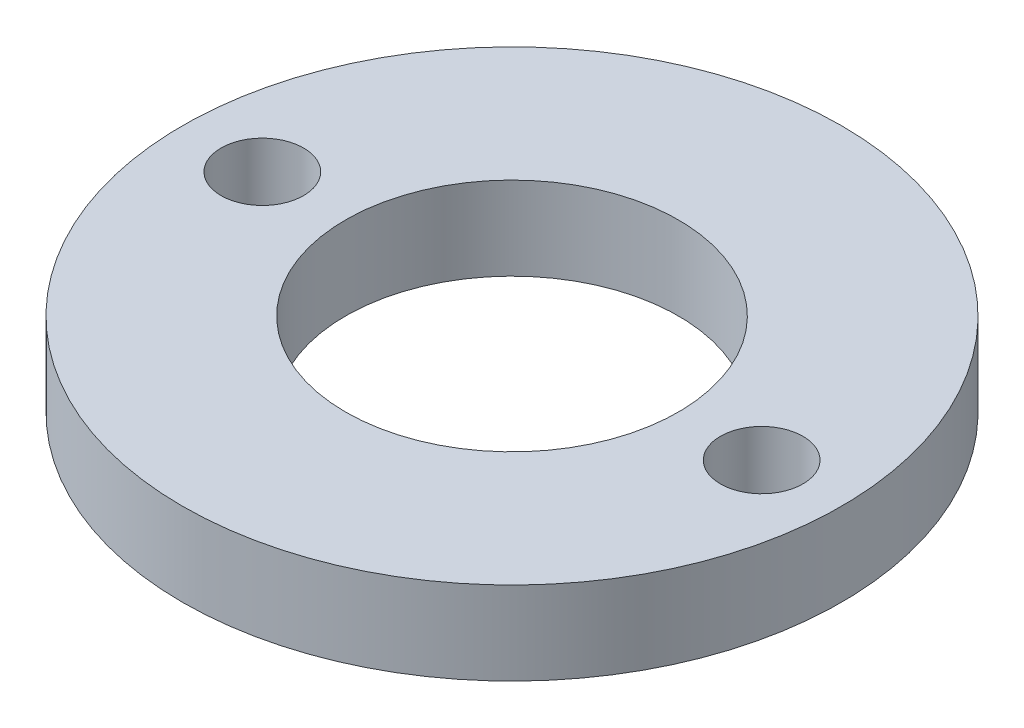
ISO-10303-21;
HEADER;
FILE_DESCRIPTION(('STEP AP214'),'2;1');
FILE_NAME('part.step','',(''),(''),'','','');
FILE_SCHEMA(('AUTOMOTIVE_DESIGN { 1 0 10303 214 1 1 1 1 }'));
ENDSEC;
DATA;
#1=APPLICATION_CONTEXT('core data for automotive mechanical design processes');
#2=APPLICATION_PROTOCOL_DEFINITION('international standard','automotive_design',2000,#1);
#3=PRODUCT_CONTEXT('',#1,'mechanical');
#4=PRODUCT('Part','Part','',(#3));
#5=PRODUCT_RELATED_PRODUCT_CATEGORY('part','',(#4));
#6=PRODUCT_DEFINITION_FORMATION('','',#4);
#7=PRODUCT_DEFINITION_CONTEXT('part definition',#1,'design');
#8=PRODUCT_DEFINITION('design','',#6,#7);
#9=PRODUCT_DEFINITION_SHAPE('','',#8);
#10=(LENGTH_UNIT() NAMED_UNIT(*) SI_UNIT(.MILLI.,.METRE.));
#11=(NAMED_UNIT(*) PLANE_ANGLE_UNIT() SI_UNIT($,.RADIAN.));
#12=(NAMED_UNIT(*) SI_UNIT($,.STERADIAN.) SOLID_ANGLE_UNIT());
#13=UNCERTAINTY_MEASURE_WITH_UNIT(LENGTH_MEASURE(1.E-05),#10,'distance_accuracy_value','');
#14=(GEOMETRIC_REPRESENTATION_CONTEXT(3) GLOBAL_UNCERTAINTY_ASSIGNED_CONTEXT((#13)) GLOBAL_UNIT_ASSIGNED_CONTEXT((#10,
#11,#12)) REPRESENTATION_CONTEXT('',''));
#15=CARTESIAN_POINT('',(0.,0.,0.));
#16=DIRECTION('',(0.,0.,1.));
#17=DIRECTION('',(1.,0.,0.));
#18=AXIS2_PLACEMENT_3D('',#15,#16,#17);
#19=CARTESIAN_POINT('',(0.,3.175,0.));
#20=DIRECTION('',(0.,1.,0.));
#21=DIRECTION('',(0.,0.,1.));
#22=AXIS2_PLACEMENT_3D('',#19,#20,#21);
#23=PLANE('',#22);
#24=CARTESIAN_POINT('',(9.525,3.175,0.));
#25=DIRECTION('',(0.,1.,0.));
#26=DIRECTION('',(0.,0.,1.));
#27=AXIS2_PLACEMENT_3D('',#24,#25,#26);
#28=CIRCLE('',#27,1.575);
#29=CARTESIAN_POINT('',(9.525,3.175,1.575));
#30=VERTEX_POINT('',#29);
#31=EDGE_CURVE('E67',#30,#30,#28,.T.);
#32=ORIENTED_EDGE('',*,*,#31,.F.);
#33=EDGE_LOOP('',(#32));
#34=FACE_BOUND('',#33,.T.);
#35=CARTESIAN_POINT('',(-9.525,3.175,0.));
#36=DIRECTION('',(0.,1.,0.));
#37=DIRECTION('',(0.,0.,1.));
#38=AXIS2_PLACEMENT_3D('',#35,#36,#37);
#39=CIRCLE('',#38,1.575);
#40=CARTESIAN_POINT('',(-9.525,3.175,1.575));
#41=VERTEX_POINT('',#40);
#42=EDGE_CURVE('E64',#41,#41,#39,.T.);
#43=ORIENTED_EDGE('',*,*,#42,.F.);
#44=EDGE_LOOP('',(#43));
#45=FACE_BOUND('',#44,.T.);
#46=CARTESIAN_POINT('',(0.,3.175,0.));
#47=DIRECTION('',(0.,1.,0.));
#48=DIRECTION('',(0.,0.,1.));
#49=AXIS2_PLACEMENT_3D('',#46,#47,#48);
#50=CIRCLE('',#49,12.573);
#51=CARTESIAN_POINT('',(0.,3.175,12.573));
#52=VERTEX_POINT('',#51);
#53=EDGE_CURVE('E10',#52,#52,#50,.T.);
#54=ORIENTED_EDGE('',*,*,#53,.T.);
#55=EDGE_LOOP('',(#54));
#56=FACE_BOUND('',#55,.T.);
#57=CARTESIAN_POINT('',(0.,3.175,0.));
#58=DIRECTION('',(0.,1.,0.));
#59=DIRECTION('',(0.,0.,1.));
#60=AXIS2_PLACEMENT_3D('',#57,#58,#59);
#61=CIRCLE('',#60,6.35);
#62=CARTESIAN_POINT('',(0.,3.175,6.35));
#63=VERTEX_POINT('',#62);
#64=EDGE_CURVE('E53',#63,#63,#61,.T.);
#65=ORIENTED_EDGE('',*,*,#64,.F.);
#66=EDGE_LOOP('',(#65));
#67=FACE_BOUND('',#66,.T.);
#68=ADVANCED_FACE('F42',(#34,#45,#56,#67),#23,.T.);
#69=CARTESIAN_POINT('',(0.,0.,0.));
#70=DIRECTION('',(0.,1.,0.));
#71=DIRECTION('',(0.,0.,1.));
#72=AXIS2_PLACEMENT_3D('',#69,#70,#71);
#73=PLANE('',#72);
#74=CARTESIAN_POINT('',(9.525,0.,0.));
#75=DIRECTION('',(0.,1.,0.));
#76=DIRECTION('',(0.,0.,1.));
#77=AXIS2_PLACEMENT_3D('',#74,#75,#76);
#78=CIRCLE('',#77,1.575);
#79=CARTESIAN_POINT('',(9.525,0.,1.575));
#80=VERTEX_POINT('',#79);
#81=EDGE_CURVE('E58',#80,#80,#78,.T.);
#82=ORIENTED_EDGE('',*,*,#81,.T.);
#83=EDGE_LOOP('',(#82));
#84=FACE_BOUND('',#83,.T.);
#85=CARTESIAN_POINT('',(-9.525,0.,0.));
#86=DIRECTION('',(0.,1.,0.));
#87=DIRECTION('',(0.,0.,1.));
#88=AXIS2_PLACEMENT_3D('',#85,#86,#87);
#89=CIRCLE('',#88,1.575);
#90=CARTESIAN_POINT('',(-9.525,0.,1.575));
#91=VERTEX_POINT('',#90);
#92=EDGE_CURVE('E61',#91,#91,#89,.T.);
#93=ORIENTED_EDGE('',*,*,#92,.T.);
#94=EDGE_LOOP('',(#93));
#95=FACE_BOUND('',#94,.T.);
#96=CARTESIAN_POINT('',(0.,0.,0.));
#97=DIRECTION('',(0.,1.,0.));
#98=DIRECTION('',(0.,0.,1.));
#99=AXIS2_PLACEMENT_3D('',#96,#97,#98);
#100=CIRCLE('',#99,12.573);
#101=CARTESIAN_POINT('',(0.,0.,12.573));
#102=VERTEX_POINT('',#101);
#103=EDGE_CURVE('E46',#102,#102,#100,.T.);
#104=ORIENTED_EDGE('',*,*,#103,.F.);
#105=EDGE_LOOP('',(#104));
#106=FACE_BOUND('',#105,.T.);
#107=CARTESIAN_POINT('',(0.,0.,0.));
#108=DIRECTION('',(0.,1.,0.));
#109=DIRECTION('',(0.,0.,1.));
#110=AXIS2_PLACEMENT_3D('',#107,#108,#109);
#111=CIRCLE('',#110,6.35);
#112=CARTESIAN_POINT('',(0.,0.,6.35));
#113=VERTEX_POINT('',#112);
#114=EDGE_CURVE('E55',#113,#113,#111,.T.);
#115=ORIENTED_EDGE('',*,*,#114,.T.);
#116=EDGE_LOOP('',(#115));
#117=FACE_BOUND('',#116,.T.);
#118=ADVANCED_FACE('F73',(#84,#95,#106,#117),#73,.F.);
#119=CARTESIAN_POINT('',(0.,3.175,0.));
#120=DIRECTION('',(0.,-1.,0.));
#121=DIRECTION('',(0.,0.,-1.));
#122=AXIS2_PLACEMENT_3D('',#119,#120,#121);
#123=CYLINDRICAL_SURFACE('',#122,12.573);
#124=ORIENTED_EDGE('',*,*,#53,.F.);
#125=EDGE_LOOP('',(#124));
#126=FACE_BOUND('',#125,.T.);
#127=ORIENTED_EDGE('',*,*,#103,.T.);
#128=EDGE_LOOP('',(#127));
#129=FACE_BOUND('',#128,.T.);
#130=ADVANCED_FACE('F44',(#126,#129),#123,.T.);
#131=CARTESIAN_POINT('',(0.,3.175,0.));
#132=DIRECTION('',(0.,-1.,0.));
#133=DIRECTION('',(0.,0.,-1.));
#134=AXIS2_PLACEMENT_3D('',#131,#132,#133);
#135=CYLINDRICAL_SURFACE('',#134,6.35);
#136=ORIENTED_EDGE('',*,*,#64,.T.);
#137=EDGE_LOOP('',(#136));
#138=FACE_BOUND('',#137,.T.);
#139=ORIENTED_EDGE('',*,*,#114,.F.);
#140=EDGE_LOOP('',(#139));
#141=FACE_BOUND('',#140,.T.);
#142=ADVANCED_FACE('F90',(#138,#141),#135,.F.);
#143=CARTESIAN_POINT('',(-9.525,0.,0.));
#144=DIRECTION('',(0.,1.,0.));
#145=DIRECTION('',(0.,0.,1.));
#146=AXIS2_PLACEMENT_3D('',#143,#144,#145);
#147=CYLINDRICAL_SURFACE('',#146,1.575);
#148=ORIENTED_EDGE('',*,*,#92,.F.);
#149=EDGE_LOOP('',(#148));
#150=FACE_BOUND('',#149,.T.);
#151=ORIENTED_EDGE('',*,*,#42,.T.);
#152=EDGE_LOOP('',(#151));
#153=FACE_BOUND('',#152,.T.);
#154=ADVANCED_FACE('F79',(#150,#153),#147,.F.);
#155=CARTESIAN_POINT('',(9.525,0.,0.));
#156=DIRECTION('',(0.,1.,0.));
#157=DIRECTION('',(0.,0.,1.));
#158=AXIS2_PLACEMENT_3D('',#155,#156,#157);
#159=CYLINDRICAL_SURFACE('',#158,1.575);
#160=ORIENTED_EDGE('',*,*,#81,.F.);
#161=EDGE_LOOP('',(#160));
#162=FACE_BOUND('',#161,.T.);
#163=ORIENTED_EDGE('',*,*,#31,.T.);
#164=EDGE_LOOP('',(#163));
#165=FACE_BOUND('',#164,.T.);
#166=ADVANCED_FACE('F76',(#162,#165),#159,.F.);
#167=CLOSED_SHELL('',(#68,#118,#130,#142,#154,#166));
#168=MANIFOLD_SOLID_BREP('B2',#167);
#169=ADVANCED_BREP_SHAPE_REPRESENTATION('',(#18,#168),#14);
#170=SHAPE_DEFINITION_REPRESENTATION(#9,#169);
ENDSEC;
END-ISO-10303-21;
